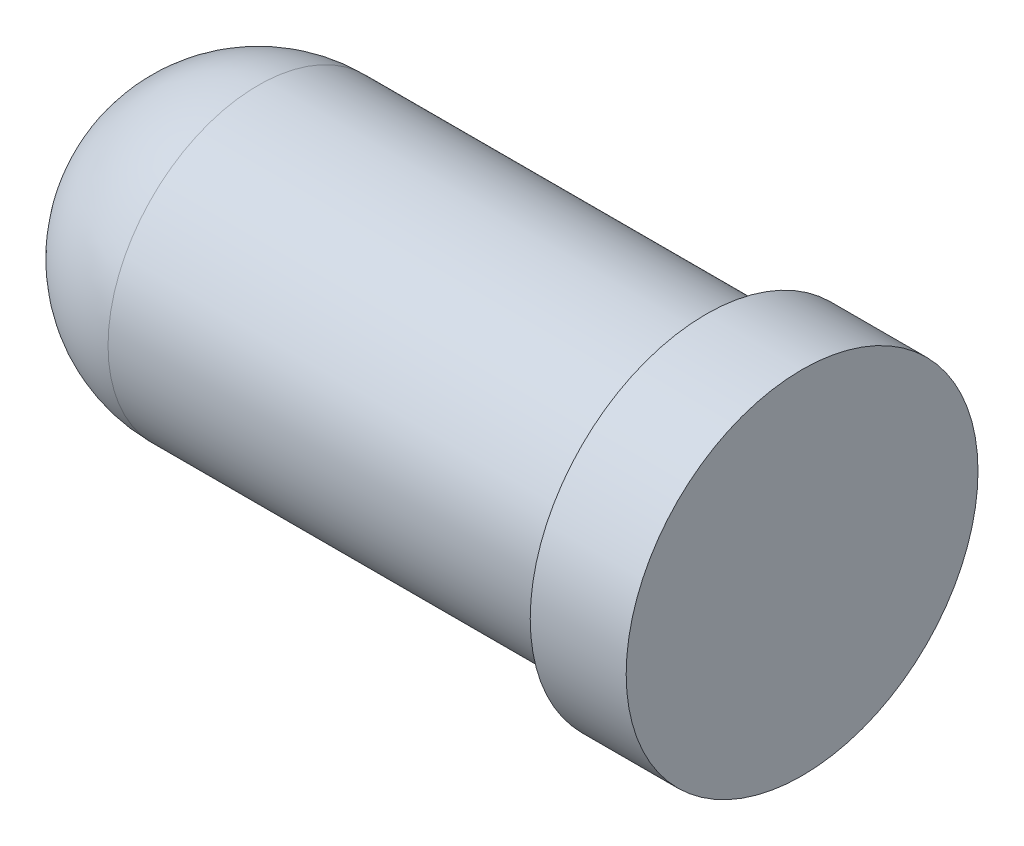
ISO-10303-21;
HEADER;
FILE_DESCRIPTION(('STEP AP214'),'2;1');
FILE_NAME('part.step','',(''),(''),'','','');
FILE_SCHEMA(('AUTOMOTIVE_DESIGN { 1 0 10303 214 1 1 1 1 }'));
ENDSEC;
DATA;
#1=APPLICATION_CONTEXT('core data for automotive mechanical design processes');
#2=APPLICATION_PROTOCOL_DEFINITION('international standard','automotive_design',2000,#1);
#3=PRODUCT_CONTEXT('',#1,'mechanical');
#4=PRODUCT('Part','Part','',(#3));
#5=PRODUCT_RELATED_PRODUCT_CATEGORY('part','',(#4));
#6=PRODUCT_DEFINITION_FORMATION('','',#4);
#7=PRODUCT_DEFINITION_CONTEXT('part definition',#1,'design');
#8=PRODUCT_DEFINITION('design','',#6,#7);
#9=PRODUCT_DEFINITION_SHAPE('','',#8);
#10=(LENGTH_UNIT() NAMED_UNIT(*) SI_UNIT(.MILLI.,.METRE.));
#11=(NAMED_UNIT(*) PLANE_ANGLE_UNIT() SI_UNIT($,.RADIAN.));
#12=(NAMED_UNIT(*) SI_UNIT($,.STERADIAN.) SOLID_ANGLE_UNIT());
#13=UNCERTAINTY_MEASURE_WITH_UNIT(LENGTH_MEASURE(1.E-05),#10,'distance_accuracy_value','');
#14=(GEOMETRIC_REPRESENTATION_CONTEXT(3) GLOBAL_UNCERTAINTY_ASSIGNED_CONTEXT((#13)) GLOBAL_UNIT_ASSIGNED_CONTEXT((#10,
#11,#12)) REPRESENTATION_CONTEXT('',''));
#15=CARTESIAN_POINT('',(0.,0.,0.));
#16=DIRECTION('',(0.,0.,1.));
#17=DIRECTION('',(1.,0.,0.));
#18=AXIS2_PLACEMENT_3D('',#15,#16,#17);
#19=CARTESIAN_POINT('',(7.,0.,0.));
#20=DIRECTION('',(-1.,0.,0.));
#21=DIRECTION('',(0.,0.,1.));
#22=AXIS2_PLACEMENT_3D('',#19,#20,#21);
#23=CYLINDRICAL_SURFACE('',#22,2.35);
#24=CARTESIAN_POINT('',(7.,0.,0.));
#25=DIRECTION('',(1.,0.,0.));
#26=DIRECTION('',(0.,0.,-1.));
#27=AXIS2_PLACEMENT_3D('',#24,#25,#26);
#28=CIRCLE('',#27,2.35);
#29=CARTESIAN_POINT('',(7.,0.,-2.35));
#30=VERTEX_POINT('',#29);
#31=EDGE_CURVE('E10',#30,#30,#28,.T.);
#32=ORIENTED_EDGE('',*,*,#31,.F.);
#33=EDGE_LOOP('',(#32));
#34=FACE_BOUND('',#33,.T.);
#35=CARTESIAN_POINT('',(0.,0.,0.));
#36=DIRECTION('',(1.,0.,0.));
#37=DIRECTION('',(0.,0.,-1.));
#38=AXIS2_PLACEMENT_3D('',#35,#36,#37);
#39=CIRCLE('',#38,2.35);
#40=CARTESIAN_POINT('',(0.,0.,-2.35));
#41=VERTEX_POINT('',#40);
#42=EDGE_CURVE('E55',#41,#41,#39,.T.);
#43=ORIENTED_EDGE('',*,*,#42,.T.);
#44=EDGE_LOOP('',(#43));
#45=FACE_BOUND('',#44,.T.);
#46=ADVANCED_FACE('F37',(#34,#45),#23,.T.);
#47=CARTESIAN_POINT('',(8.5,0.,0.));
#48=DIRECTION('',(-1.,0.,0.));
#49=DIRECTION('',(0.,0.,1.));
#50=AXIS2_PLACEMENT_3D('',#47,#48,#49);
#51=CYLINDRICAL_SURFACE('',#50,2.75);
#52=CARTESIAN_POINT('',(8.5,0.,0.));
#53=DIRECTION('',(1.,0.,0.));
#54=DIRECTION('',(0.,0.,-1.));
#55=AXIS2_PLACEMENT_3D('',#52,#53,#54);
#56=CIRCLE('',#55,2.75);
#57=CARTESIAN_POINT('',(8.5,0.,-2.75));
#58=VERTEX_POINT('',#57);
#59=EDGE_CURVE('E44',#58,#58,#56,.T.);
#60=ORIENTED_EDGE('',*,*,#59,.F.);
#61=EDGE_LOOP('',(#60));
#62=FACE_BOUND('',#61,.T.);
#63=CARTESIAN_POINT('',(7.,0.,0.));
#64=DIRECTION('',(1.,0.,0.));
#65=DIRECTION('',(0.,0.,-1.));
#66=AXIS2_PLACEMENT_3D('',#63,#64,#65);
#67=CIRCLE('',#66,2.75);
#68=CARTESIAN_POINT('',(7.,0.,-2.75));
#69=VERTEX_POINT('',#68);
#70=EDGE_CURVE('E49',#69,#69,#67,.T.);
#71=ORIENTED_EDGE('',*,*,#70,.T.);
#72=EDGE_LOOP('',(#71));
#73=FACE_BOUND('',#72,.T.);
#74=ADVANCED_FACE('F73',(#62,#73),#51,.T.);
#75=CARTESIAN_POINT('',(8.5,0.,0.));
#76=DIRECTION('',(1.,0.,0.));
#77=DIRECTION('',(0.,0.,-1.));
#78=AXIS2_PLACEMENT_3D('',#75,#76,#77);
#79=PLANE('',#78);
#80=ORIENTED_EDGE('',*,*,#59,.T.);
#81=EDGE_LOOP('',(#80));
#82=FACE_BOUND('',#81,.T.);
#83=ADVANCED_FACE('F69',(#82),#79,.T.);
#84=CARTESIAN_POINT('',(7.,0.,0.));
#85=DIRECTION('',(1.,0.,0.));
#86=DIRECTION('',(0.,0.,-1.));
#87=AXIS2_PLACEMENT_3D('',#84,#85,#86);
#88=PLANE('',#87);
#89=ORIENTED_EDGE('',*,*,#31,.T.);
#90=EDGE_LOOP('',(#89));
#91=FACE_BOUND('',#90,.T.);
#92=ORIENTED_EDGE('',*,*,#70,.F.);
#93=EDGE_LOOP('',(#92));
#94=FACE_BOUND('',#93,.T.);
#95=ADVANCED_FACE('F64',(#91,#94),#88,.F.);
#96=CARTESIAN_POINT('',(0.,0.,0.));
#97=DIRECTION('',(0.,1.,0.));
#98=DIRECTION('',(1.,0.,0.));
#99=AXIS2_PLACEMENT_3D('',#96,#97,#98);
#100=SPHERICAL_SURFACE('',#99,2.35);
#101=CARTESIAN_POINT('',(0.,0.,0.));
#102=DIRECTION('',(1.,0.,0.));
#103=DIRECTION('',(0.,0.,-1.));
#104=AXIS2_PLACEMENT_3D('',#101,#102,#103);
#105=SPHERICAL_SURFACE('',#104,2.35);
#106=ORIENTED_EDGE('',*,*,#42,.F.);
#107=EDGE_LOOP('',(#106));
#108=FACE_BOUND('',#107,.T.);
#109=ADVANCED_FACE('F62',(#108),#105,.T.);
#110=CLOSED_SHELL('',(#46,#74,#83,#95,#109));
#111=MANIFOLD_SOLID_BREP('B2',#110);
#112=ADVANCED_BREP_SHAPE_REPRESENTATION('',(#18,#111),#14);
#113=SHAPE_DEFINITION_REPRESENTATION(#9,#112);
ENDSEC;
END-ISO-10303-21;
